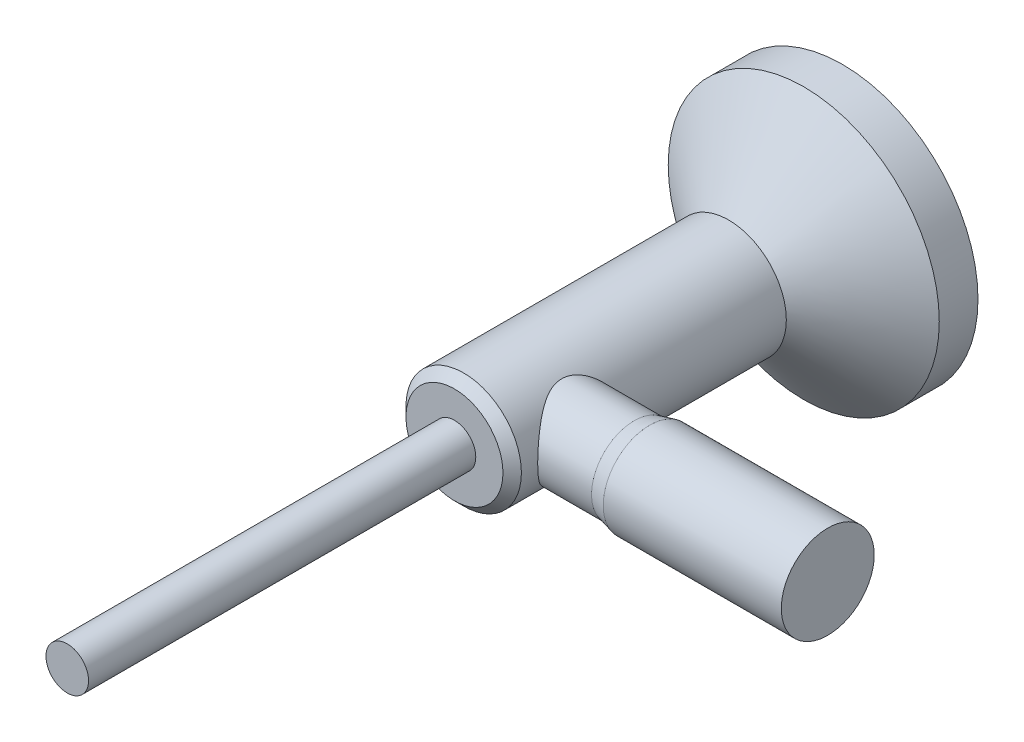
ISO-10303-21;
HEADER;
FILE_DESCRIPTION(('STEP AP214'),'2;1');
FILE_NAME('part.step','',(''),(''),'','','');
FILE_SCHEMA(('AUTOMOTIVE_DESIGN { 1 0 10303 214 1 1 1 1 }'));
ENDSEC;
DATA;
#1=APPLICATION_CONTEXT('core data for automotive mechanical design processes');
#2=APPLICATION_PROTOCOL_DEFINITION('international standard','automotive_design',2000,#1);
#3=PRODUCT_CONTEXT('',#1,'mechanical');
#4=PRODUCT('Part','Part','',(#3));
#5=PRODUCT_RELATED_PRODUCT_CATEGORY('part','',(#4));
#6=PRODUCT_DEFINITION_FORMATION('','',#4);
#7=PRODUCT_DEFINITION_CONTEXT('part definition',#1,'design');
#8=PRODUCT_DEFINITION('design','',#6,#7);
#9=PRODUCT_DEFINITION_SHAPE('','',#8);
#10=(LENGTH_UNIT() NAMED_UNIT(*) SI_UNIT(.MILLI.,.METRE.));
#11=(NAMED_UNIT(*) PLANE_ANGLE_UNIT() SI_UNIT($,.RADIAN.));
#12=(NAMED_UNIT(*) SI_UNIT($,.STERADIAN.) SOLID_ANGLE_UNIT());
#13=UNCERTAINTY_MEASURE_WITH_UNIT(LENGTH_MEASURE(1.E-05),#10,'distance_accuracy_value','');
#14=(GEOMETRIC_REPRESENTATION_CONTEXT(3) GLOBAL_UNCERTAINTY_ASSIGNED_CONTEXT((#13)) GLOBAL_UNIT_ASSIGNED_CONTEXT((#10,
#11,#12)) REPRESENTATION_CONTEXT('',''));
#15=CARTESIAN_POINT('',(0.,0.,0.));
#16=DIRECTION('',(0.,0.,1.));
#17=DIRECTION('',(1.,0.,0.));
#18=AXIS2_PLACEMENT_3D('',#15,#16,#17);
#19=CARTESIAN_POINT('',(0.,0.,50.1));
#20=DIRECTION('',(0.,0.,-1.));
#21=DIRECTION('',(-1.,0.,0.));
#22=AXIS2_PLACEMENT_3D('',#19,#20,#21);
#23=CYLINDRICAL_SURFACE('',#22,7.45);
#24=CARTESIAN_POINT('',(0.,0.,48.91));
#25=DIRECTION('',(0.,0.,1.));
#26=DIRECTION('',(1.,0.,0.));
#27=AXIS2_PLACEMENT_3D('',#24,#25,#26);
#28=CIRCLE('',#27,7.45);
#29=CARTESIAN_POINT('',(7.45,0.,48.91));
#30=VERTEX_POINT('',#29);
#31=EDGE_CURVE('E49',#30,#30,#28,.F.);
#32=ORIENTED_EDGE('',*,*,#31,.T.);
#33=EDGE_LOOP('',(#32));
#34=FACE_BOUND('',#33,.T.);
#35=CARTESIAN_POINT('',(0.,0.,14.7));
#36=DIRECTION('',(0.,0.,1.));
#37=DIRECTION('',(1.,0.,0.));
#38=AXIS2_PLACEMENT_3D('',#35,#36,#37);
#39=CIRCLE('',#38,7.45);
#40=CARTESIAN_POINT('',(7.45,0.,14.7));
#41=VERTEX_POINT('',#40);
#42=EDGE_CURVE('E113',#41,#41,#39,.T.);
#43=ORIENTED_EDGE('',*,*,#42,.T.);
#44=EDGE_LOOP('',(#43));
#45=FACE_BOUND('',#44,.T.);
#46=CARTESIAN_POINT('',(7.45,0.,46.8));
#47=CARTESIAN_POINT('',(7.450000486101,-0.135019458593923,46.8000005141358));
#48=CARTESIAN_POINT('',(7.44632219923632,-0.270032839258495,46.7950212855718));
#49=CARTESIAN_POINT('',(7.43169815251342,-0.538985340011845,46.7751879005484));
#50=CARTESIAN_POINT('',(7.42074970160522,-0.672924043722487,46.7603300875302));
#51=CARTESIAN_POINT('',(7.39184729895434,-0.9385877035249,46.7209855450049));
#52=CARTESIAN_POINT('',(7.37389420686385,-1.07031292919976,46.6964999970691));
#53=CARTESIAN_POINT('',(7.33138754280582,-1.33066367835124,46.6382711386633));
#54=CARTESIAN_POINT('',(7.30683110939465,-1.45928783163998,46.6045238146319));
#55=CARTESIAN_POINT('',(7.25180537769183,-1.71184827574825,46.5284670413951));
#56=CARTESIAN_POINT('',(7.22137023076594,-1.83580692596372,46.486206987383));
#57=CARTESIAN_POINT('',(7.15510269098157,-2.07916770368903,46.3935290824373));
#58=CARTESIAN_POINT('',(7.11926816916999,-2.19856801048152,46.3431080130618));
#59=CARTESIAN_POINT('',(7.00466209995162,-2.54901546437438,46.180446253102));
#60=CARTESIAN_POINT('',(6.91873854566016,-2.77252833817957,46.0567397830527));
#61=CARTESIAN_POINT('',(6.7249767621068,-3.21575231262227,45.7704513796907));
#62=CARTESIAN_POINT('',(6.61585223742397,-3.43324080201589,45.6053467935411));
#63=CARTESIAN_POINT('',(6.38870455841173,-3.83941362643512,45.2474404781813));
#64=CARTESIAN_POINT('',(6.27066830525156,-4.02805427819545,45.0545975861147));
#65=CARTESIAN_POINT('',(6.08134260993173,-4.3053034012533,44.7264040763676));
#66=CARTESIAN_POINT('',(6.0102930897951,-4.40368577346437,44.5990186175818));
#67=CARTESIAN_POINT('',(5.86975893861383,-4.58933172885816,44.335461330077));
#68=CARTESIAN_POINT('',(5.80027477073608,-4.67659205584361,44.1992869457243));
#69=CARTESIAN_POINT('',(5.66514739944463,-4.83939945668332,43.9184939116281));
#70=CARTESIAN_POINT('',(5.59950014045067,-4.91495904280386,43.7738845130287));
#71=CARTESIAN_POINT('',(5.47456219475328,-5.05374916866248,43.4763688744005));
#72=CARTESIAN_POINT('',(5.41526793783756,-5.11698664961671,43.3234673678531));
#73=CARTESIAN_POINT('',(5.28810095160074,-5.24875333895413,42.9581537446772));
#74=CARTESIAN_POINT('',(5.22373565849846,-5.31228408284939,42.7425942184785));
#75=CARTESIAN_POINT('',(5.14536790644501,-5.38785688611981,42.4108003817203));
#76=CARTESIAN_POINT('',(5.12228314922296,-5.4097538951355,42.2988579572337));
#77=CARTESIAN_POINT('',(5.08302472939188,-5.44665854692892,42.0726693241491));
#78=CARTESIAN_POINT('',(5.06684757293834,-5.46166967285253,41.9584243108891));
#79=CARTESIAN_POINT('',(5.04201202171943,-5.48460630454058,41.7274132506697));
#80=CARTESIAN_POINT('',(5.0334187547392,-5.49247045134611,41.6106340254534));
#81=CARTESIAN_POINT('',(5.02440752742795,-5.50071518777274,41.3764958030607));
#82=CARTESIAN_POINT('',(5.02398921940845,-5.50109609566283,41.2591368307537));
#83=CARTESIAN_POINT('',(5.03135144579266,-5.49436315375481,41.0248316849857));
#84=CARTESIAN_POINT('',(5.03913645136315,-5.48724521675679,40.9078857715351));
#85=CARTESIAN_POINT('',(5.06252538772141,-5.46567348545005,40.6754668439777));
#86=CARTESIAN_POINT('',(5.07813017889333,-5.45121888391109,40.5599939933811));
#87=CARTESIAN_POINT('',(5.11841445080765,-5.41342488438579,40.3196410592587));
#88=CARTESIAN_POINT('',(5.14385968987857,-5.38932711143999,40.1950088305846));
#89=CARTESIAN_POINT('',(5.20216856833407,-5.3330653125853,39.9493241036273));
#90=CARTESIAN_POINT('',(5.23503716222852,-5.30089589788714,39.8282740574803));
#91=CARTESIAN_POINT('',(5.34287105318585,-5.19293068721941,39.4709534137172));
#92=CARTESIAN_POINT('',(5.42701329006843,-5.10572277214488,39.2407866817355));
#93=CARTESIAN_POINT('',(5.58031756374245,-4.93671279925376,38.8697332254147));
#94=CARTESIAN_POINT('',(5.6456806582952,-4.86208039880709,38.7238108417375));
#95=CARTESIAN_POINT('',(5.78047024466221,-4.70102974079245,38.440480884177));
#96=CARTESIAN_POINT('',(5.84989809668093,-4.61460752493874,38.3030761926343));
#97=CARTESIAN_POINT('',(5.99061149543245,-4.43040948051434,38.0369184224878));
#98=CARTESIAN_POINT('',(6.06189877157229,-4.33262276719967,37.908173827808));
#99=CARTESIAN_POINT('',(6.20432572080933,-4.12608497718545,37.6597380543207));
#100=CARTESIAN_POINT('',(6.27546541024707,-4.01733518858694,37.5400458147968));
#101=CARTESIAN_POINT('',(6.41694042359449,-3.78733255021641,37.3083628806047));
#102=CARTESIAN_POINT('',(6.48724620707226,-3.66591208641068,37.196520245622));
#103=CARTESIAN_POINT('',(6.62418692275544,-3.4122459566642,36.9832850585178));
#104=CARTESIAN_POINT('',(6.69082145547511,-3.27999911653231,36.8818936426005));
#105=CARTESIAN_POINT('',(6.81860613459969,-3.00533033204449,36.6906685237157));
#106=CARTESIAN_POINT('',(6.87976666430903,-2.86292861362233,36.6008127923865));
#107=CARTESIAN_POINT('',(6.99508249609034,-2.56832914069526,36.4335487435955));
#108=CARTESIAN_POINT('',(7.04924040888451,-2.41613506886164,36.3561357845757));
#109=CARTESIAN_POINT('',(7.13621154881264,-2.14288963573746,36.2330094185123));
#110=CARTESIAN_POINT('',(7.17094351690687,-2.02381204003309,36.1842495487851));
#111=CARTESIAN_POINT('',(7.2350088382771,-1.78125520573237,36.0948268850267));
#112=CARTESIAN_POINT('',(7.26434339114959,-1.65777695249939,36.0541622916239));
#113=CARTESIAN_POINT('',(7.31702705028384,-1.40712697114765,35.9814463890465));
#114=CARTESIAN_POINT('',(7.34037924798169,-1.27995718864046,35.9493906307632));
#115=CARTESIAN_POINT('',(7.38062463675137,-1.02265971948758,35.8943109643801));
#116=CARTESIAN_POINT('',(7.39751766698041,-0.892531959269352,35.871287281192));
#117=CARTESIAN_POINT('',(7.42451943848907,-0.629708602602006,35.8345498798639));
#118=CARTESIAN_POINT('',(7.43459967886032,-0.497004578912932,35.8208752703012));
#119=CARTESIAN_POINT('',(7.44762424349014,-0.230601856620336,35.8032152514379));
#120=CARTESIAN_POINT('',(7.45056857724733,-0.0969031593410616,35.7992298292399));
#121=CARTESIAN_POINT('',(7.44925019338425,0.170391950321274,35.801015655425));
#122=CARTESIAN_POINT('',(7.44498752920273,0.303988363455408,35.8067868314644));
#123=CARTESIAN_POINT('',(7.42935848088875,0.56998576200324,35.8279877158631));
#124=CARTESIAN_POINT('',(7.41799233561598,0.702386787460855,35.8434170994582));
#125=CARTESIAN_POINT('',(7.38937676239725,0.956496358037278,35.8823849821495));
#126=CARTESIAN_POINT('',(7.37255414233543,1.07834370318576,35.9053361842937));
#127=CARTESIAN_POINT('',(7.33326109650566,1.3193631552748,35.9591618788812));
#128=CARTESIAN_POINT('',(7.3107887493593,1.43853433704692,35.9900390668961));
#129=CARTESIAN_POINT('',(7.23550792067242,1.79094132264636,36.0940037903012));
#130=CARTESIAN_POINT('',(7.17481312231734,2.01926240205647,36.1784546242394));
#131=CARTESIAN_POINT('',(7.03119931111775,2.47512724804147,36.3815843386185));
#132=CARTESIAN_POINT('',(6.94693853194631,2.70128412511467,36.5023821929634));
#133=CARTESIAN_POINT('',(6.76428371538492,3.13072963795313,36.77090265567));
#134=CARTESIAN_POINT('',(6.66588151914327,3.33400495069193,36.9186408204923));
#135=CARTESIAN_POINT('',(6.44179179209608,3.75122450320924,37.2669884948347));
#136=CARTESIAN_POINT('',(6.31440858456013,3.96029801735132,37.4723255534379));
#137=CARTESIAN_POINT('',(6.05743313163926,4.34316706492005,37.9129348253169));
#138=CARTESIAN_POINT('',(5.92783877099392,4.51692649670822,38.1482372766247));
#139=CARTESIAN_POINT('',(5.7460586993252,4.74274864373499,38.5117446481609));
#140=CARTESIAN_POINT('',(5.68997135582281,4.80974394040677,38.6289112914586));
#141=CARTESIAN_POINT('',(5.58124078215675,4.93549987098832,38.8691064408317));
#142=CARTESIAN_POINT('',(5.52859776915992,4.99425998593184,38.9921353156802));
#143=CARTESIAN_POINT('',(5.37831276483957,5.15732327585902,39.3694759856688));
#144=CARTESIAN_POINT('',(5.2879813572329,5.24880763196806,39.6326759475614));
#145=CARTESIAN_POINT('',(5.15966841115067,5.37461552771487,40.1129151304156));
#146=CARTESIAN_POINT('',(5.11430739717961,5.41741575225532,40.3257020095138));
#147=CARTESIAN_POINT('',(5.0658799619334,5.46258228172044,40.6502597640486));
#148=CARTESIAN_POINT('',(5.05300730686033,5.47446486544369,40.7593125309629));
#149=CARTESIAN_POINT('',(5.03427877208945,5.49169488037731,40.9785155352214));
#150=CARTESIAN_POINT('',(5.02842035211825,5.49704467751378,41.0886653606736));
#151=CARTESIAN_POINT('',(5.02397767853765,5.50110488586305,41.3095765532073));
#152=CARTESIAN_POINT('',(5.02541616542765,5.49979454100168,41.4203387561794));
#153=CARTESIAN_POINT('',(5.03555095430713,5.49051667508094,41.6412447938616));
#154=CARTESIAN_POINT('',(5.04424719934845,5.48254920625684,41.7513886334168));
#155=CARTESIAN_POINT('',(5.06853112465503,5.46010653011939,41.9703446016663));
#156=CARTESIAN_POINT('',(5.08412558122923,5.44562492354684,42.0791553125084));
#157=CARTESIAN_POINT('',(5.12158696806766,5.41040710319368,42.2947016837112));
#158=CARTESIAN_POINT('',(5.14345709733763,5.38966769924076,42.4014362560617));
#159=CARTESIAN_POINT('',(5.19936820852396,5.33581831565247,42.6408589302919));
#160=CARTESIAN_POINT('',(5.23510132752425,5.30087903193012,42.7727417267996));
#161=CARTESIAN_POINT('',(5.31374732876396,5.22203843533893,43.0316627434205));
#162=CARTESIAN_POINT('',(5.3566658009176,5.17813013904173,43.1586970964169));
#163=CARTESIAN_POINT('',(5.44808284756704,5.08186043842302,43.4077362410937));
#164=CARTESIAN_POINT('',(5.49659218116849,5.02948265460939,43.5297307001153));
#165=CARTESIAN_POINT('',(5.59758409112259,4.91683590270793,43.7682206786451));
#166=CARTESIAN_POINT('',(5.65006531675744,4.85656961221656,43.884718045859));
#167=CARTESIAN_POINT('',(5.77333661285875,4.70985473812738,44.1452882719613));
#168=CARTESIAN_POINT('',(5.84501307878994,4.62088856708074,44.2875293132532));
#169=CARTESIAN_POINT('',(5.99031979512397,4.43090107781332,44.562679021548));
#170=CARTESIAN_POINT('',(6.06395053560598,4.32987671308233,44.6955853165916));
#171=CARTESIAN_POINT('',(6.211060528061,4.11607518071445,44.9518182201894));
#172=CARTESIAN_POINT('',(6.28453968373324,4.00329205106679,45.0751399132397));
#173=CARTESIAN_POINT('',(6.42937294776092,3.76629130969224,45.3116164333594));
#174=CARTESIAN_POINT('',(6.50072726097624,3.64207480503242,45.4247722426754));
#175=CARTESIAN_POINT('',(6.63975469649077,3.3820076403295,45.6405845799124));
#176=CARTESIAN_POINT('',(6.70741368670676,3.24611682230352,45.7432019651793));
#177=CARTESIAN_POINT('',(6.83699285944623,2.96347666779423,45.9364978474031));
#178=CARTESIAN_POINT('',(6.89891258221888,2.81672646309734,46.027175388149));
#179=CARTESIAN_POINT('',(7.01512754921521,2.51332863324963,46.1952210285571));
#180=CARTESIAN_POINT('',(7.06943760345273,2.35670111826006,46.2726150487229));
#181=CARTESIAN_POINT('',(7.16885202141445,2.03432479622376,46.4129633402488));
#182=CARTESIAN_POINT('',(7.2139597392386,1.86857934058326,46.475922873781));
#183=CARTESIAN_POINT('',(7.28525957439485,1.56418947590783,46.5747911948319));
#184=CARTESIAN_POINT('',(7.31343362965212,1.42694458749129,46.613599197172));
#185=CARTESIAN_POINT('',(7.3622804921818,1.14859710719614,46.6806321910422));
#186=CARTESIAN_POINT('',(7.38295496411308,1.00749537889478,46.708859531175));
#187=CARTESIAN_POINT('',(7.41624966104453,0.722690307571883,46.7542181874457));
#188=CARTESIAN_POINT('',(7.42887613147247,0.578989071107694,46.7713581078216));
#189=CARTESIAN_POINT('',(7.44575087523034,0.290189513523673,46.7942485141783));
#190=CARTESIAN_POINT('',(7.44999947763825,0.145091247503364,46.7999994475121));
#191=CARTESIAN_POINT('',(7.45,0.,46.8));
#192=B_SPLINE_CURVE_WITH_KNOTS('',3,(#46,#47,#48,#49,#50,#51,#52,#53,#54,#55,#56,#57,#58,#59,
#60,#61,#62,#63,#64,#65,#66,#67,#68,#69,#70,#71,#72,#73,#74,#75,#76,#77,#78,#79,#80,#81,#82,#83,
#84,#85,#86,#87,#88,#89,#90,#91,#92,#93,#94,#95,#96,#97,#98,#99,#100,#101,#102,#103,#104,#105,
#106,#107,#108,#109,#110,#111,#112,#113,#114,#115,#116,#117,#118,#119,#120,#121,#122,#123,#124,
#125,#126,#127,#128,#129,#130,#131,#132,#133,#134,#135,#136,#137,#138,#139,#140,#141,#142,#143,
#144,#145,#146,#147,#148,#149,#150,#151,#152,#153,#154,#155,#156,#157,#158,#159,#160,#161,#162,
#163,#164,#165,#166,#167,#168,#169,#170,#171,#172,#173,#174,#175,#176,#177,#178,#179,#180,#181,
#182,#183,#184,#185,#186,#187,#188,#189,#190,#191),.UNSPECIFIED.,.T.,.F.,(4,2,2,2,2,2,2,2,2,2,2,
2,2,2,2,2,2,2,2,2,2,2,2,2,2,2,2,2,2,2,2,2,2,2,2,2,2,2,2,2,2,2,2,2,2,2,2,2,2,2,2,2,2,2,2,2,2,2,2,
2,2,2,2,2,2,2,2,2,2,2,2,2,4),(0.,0.404907429741863,0.809964819506974,1.21497251379279,
1.62015599476134,2.02305282192515,2.42610892752499,3.23152520477046,4.11069908411092,
4.99119135669979,5.51851353807913,6.0459897504932,6.57289794844336,7.09950846798783,
7.79783710626463,8.14661363775009,8.49521354950535,8.84677877502025,9.19832904811213,
9.55007103072747,9.90185172280483,10.2896630286505,10.6777339372023,11.4547132149265,
11.9835306539278,12.5125260758485,13.0420324032904,13.5714765890022,14.1091238969619,
14.6468295937284,15.1834927196246,15.7199551857979,16.1194037290293,16.518763385747,
16.9179162515587,17.317079056218,17.7179015666721,18.1187235435904,18.5195425484913,
18.9203480762889,19.2952989128703,19.6703774369071,20.4199546537079,21.2266902154778,
22.0338931037647,22.989012218223,23.9451028945316,24.3832396766988,24.8214040570499,
25.6952974872321,26.3576097802786,26.6885918563516,27.0194540277577,27.3513479493187,
27.6832392666913,28.0154573368454,28.3478450559364,28.7703100360001,29.193105217099,
29.6167280596519,30.0402074829446,30.5868264236729,31.1335837615167,31.6806196807947,
32.2276026874687,32.7765489700372,33.3255391886626,33.8734456578762,34.4211520660085,
34.85671577934,35.2921827527213,35.727311381309,36.1624229179455),.UNSPECIFIED.);
#193=CARTESIAN_POINT('',(7.45,0.,46.8));
#194=VERTEX_POINT('',#193);
#195=EDGE_CURVE('E57',#194,#194,#192,.T.);
#196=ORIENTED_EDGE('',*,*,#195,.F.);
#197=EDGE_LOOP('',(#196));
#198=FACE_BOUND('',#197,.T.);
#199=ADVANCED_FACE('F41',(#34,#45,#198),#23,.T.);
#200=CARTESIAN_POINT('',(0.,0.,5.));
#201=DIRECTION('',(0.,0.,-1.));
#202=DIRECTION('',(-1.,0.,0.));
#203=AXIS2_PLACEMENT_3D('',#200,#201,#202);
#204=CYLINDRICAL_SURFACE('',#203,17.5);
#205=CARTESIAN_POINT('',(0.,0.,4.99999999999997));
#206=DIRECTION('',(0.,0.,1.));
#207=DIRECTION('',(1.,0.,0.));
#208=AXIS2_PLACEMENT_3D('',#205,#206,#207);
#209=CIRCLE('',#208,17.5);
#210=CARTESIAN_POINT('',(-17.5,0.,4.99999999999997));
#211=VERTEX_POINT('',#210);
#212=EDGE_CURVE('E68',#211,#211,#209,.F.);
#213=ORIENTED_EDGE('',*,*,#212,.T.);
#214=EDGE_LOOP('',(#213));
#215=FACE_BOUND('',#214,.T.);
#216=CARTESIAN_POINT('',(0.,0.,0.));
#217=DIRECTION('',(0.,0.,1.));
#218=DIRECTION('',(1.,0.,0.));
#219=AXIS2_PLACEMENT_3D('',#216,#217,#218);
#220=CIRCLE('',#219,17.5);
#221=CARTESIAN_POINT('',(17.5,0.,0.));
#222=VERTEX_POINT('',#221);
#223=EDGE_CURVE('E116',#222,#222,#220,.T.);
#224=ORIENTED_EDGE('',*,*,#223,.T.);
#225=EDGE_LOOP('',(#224));
#226=FACE_BOUND('',#225,.T.);
#227=ADVANCED_FACE('F102',(#215,#226),#204,.T.);
#228=CARTESIAN_POINT('',(0.,0.,0.));
#229=DIRECTION('',(0.,0.,1.));
#230=DIRECTION('',(1.,0.,0.));
#231=AXIS2_PLACEMENT_3D('',#228,#229,#230);
#232=PLANE('',#231);
#233=ORIENTED_EDGE('',*,*,#223,.F.);
#234=EDGE_LOOP('',(#233));
#235=FACE_BOUND('',#234,.T.);
#236=ADVANCED_FACE('F106',(#235),#232,.F.);
#237=CARTESIAN_POINT('',(0.,0.,14.7));
#238=DIRECTION('',(0.,0.,-1.));
#239=DIRECTION('',(-1.,0.,0.));
#240=AXIS2_PLACEMENT_3D('',#237,#238,#239);
#241=CONICAL_SURFACE('',#240,4.44999999999995,0.931600234456651);
#242=CARTESIAN_POINT('',(0.,0.,14.7));
#243=DIRECTION('',(0.,0.,1.));
#244=DIRECTION('',(1.,0.,0.));
#245=AXIS2_PLACEMENT_3D('',#242,#243,#244);
#246=CIRCLE('',#245,4.44999999999995);
#247=CARTESIAN_POINT('',(-4.44999999999995,0.,14.7));
#248=VERTEX_POINT('',#247);
#249=EDGE_CURVE('E120',#248,#248,#246,.T.);
#250=CARTESIAN_POINT('',(-17.5,0.,4.99999999999997));
#251=CARTESIAN_POINT('',(-17.3640625,0.,5.10104166666664));
#252=CARTESIAN_POINT('',(-17.228125,0.,5.20208333333331));
#253=CARTESIAN_POINT('',(-16.95625,0.,5.40416666666664));
#254=CARTESIAN_POINT('',(-16.8203125,0.,5.50520833333331));
#255=CARTESIAN_POINT('',(-16.5484375,0.,5.70729166666664));
#256=CARTESIAN_POINT('',(-16.4125,0.,5.80833333333331));
#257=CARTESIAN_POINT('',(-16.140625,0.,6.01041666666664));
#258=CARTESIAN_POINT('',(-16.0046875,0.,6.11145833333331));
#259=CARTESIAN_POINT('',(-15.7328125,0.,6.31354166666664));
#260=CARTESIAN_POINT('',(-15.596875,0.,6.41458333333331));
#261=CARTESIAN_POINT('',(-15.325,0.,6.61666666666664));
#262=CARTESIAN_POINT('',(-15.1890625,0.,6.71770833333331));
#263=CARTESIAN_POINT('',(-14.9171875,0.,6.91979166666664));
#264=CARTESIAN_POINT('',(-14.78125,0.,7.02083333333331));
#265=CARTESIAN_POINT('',(-14.509375,0.,7.22291666666665));
#266=CARTESIAN_POINT('',(-14.3734375,0.,7.32395833333331));
#267=CARTESIAN_POINT('',(-14.1015625,0.,7.52604166666665));
#268=CARTESIAN_POINT('',(-13.965625,0.,7.62708333333331));
#269=CARTESIAN_POINT('',(-13.69375,0.,7.82916666666665));
#270=CARTESIAN_POINT('',(-13.5578125,0.,7.93020833333331));
#271=CARTESIAN_POINT('',(-13.2859375,0.,8.13229166666665));
#272=CARTESIAN_POINT('',(-13.15,0.,8.23333333333331));
#273=CARTESIAN_POINT('',(-12.878125,0.,8.43541666666665));
#274=CARTESIAN_POINT('',(-12.7421875,0.,8.53645833333331));
#275=CARTESIAN_POINT('',(-12.4703125,0.,8.73854166666665));
#276=CARTESIAN_POINT('',(-12.334375,0.,8.83958333333332));
#277=CARTESIAN_POINT('',(-12.0625,0.,9.04166666666665));
#278=CARTESIAN_POINT('',(-11.9265625,0.,9.14270833333332));
#279=CARTESIAN_POINT('',(-11.6546875,0.,9.34479166666665));
#280=CARTESIAN_POINT('',(-11.51875,0.,9.44583333333332));
#281=CARTESIAN_POINT('',(-11.246875,0.,9.64791666666665));
#282=CARTESIAN_POINT('',(-11.1109375,0.,9.74895833333332));
#283=CARTESIAN_POINT('',(-10.8390625,0.,9.95104166666665));
#284=CARTESIAN_POINT('',(-10.703125,0.,10.0520833333333));
#285=CARTESIAN_POINT('',(-10.43125,0.,10.2541666666667));
#286=CARTESIAN_POINT('',(-10.2953125,0.,10.3552083333333));
#287=CARTESIAN_POINT('',(-10.0234375,0.,10.5572916666667));
#288=CARTESIAN_POINT('',(-9.88749999999997,0.,10.6583333333333));
#289=CARTESIAN_POINT('',(-9.61562499999997,0.,10.8604166666667));
#290=CARTESIAN_POINT('',(-9.47968749999997,0.,10.9614583333333));
#291=CARTESIAN_POINT('',(-9.20781249999997,0.,11.1635416666667));
#292=CARTESIAN_POINT('',(-9.07187499999997,0.,11.2645833333333));
#293=CARTESIAN_POINT('',(-8.79999999999997,0.,11.4666666666667));
#294=CARTESIAN_POINT('',(-8.66406249999997,0.,11.5677083333333));
#295=CARTESIAN_POINT('',(-8.39218749999996,0.,11.7697916666667));
#296=CARTESIAN_POINT('',(-8.25624999999996,0.,11.8708333333333));
#297=CARTESIAN_POINT('',(-7.98437499999996,0.,12.0729166666667));
#298=CARTESIAN_POINT('',(-7.84843749999996,0.,12.1739583333333));
#299=CARTESIAN_POINT('',(-7.57656249999996,0.,12.3760416666667));
#300=CARTESIAN_POINT('',(-7.44062499999996,0.,12.4770833333333));
#301=CARTESIAN_POINT('',(-7.16874999999996,0.,12.6791666666667));
#302=CARTESIAN_POINT('',(-7.03281249999996,0.,12.7802083333333));
#303=CARTESIAN_POINT('',(-6.76093749999996,0.,12.9822916666667));
#304=CARTESIAN_POINT('',(-6.62499999999996,0.,13.0833333333333));
#305=CARTESIAN_POINT('',(-6.35312499999996,0.,13.2854166666667));
#306=CARTESIAN_POINT('',(-6.21718749999995,0.,13.3864583333333));
#307=CARTESIAN_POINT('',(-5.94531249999995,0.,13.5885416666667));
#308=CARTESIAN_POINT('',(-5.80937499999995,0.,13.6895833333333));
#309=CARTESIAN_POINT('',(-5.53749999999995,0.,13.8916666666667));
#310=CARTESIAN_POINT('',(-5.40156249999995,0.,13.9927083333333));
#311=CARTESIAN_POINT('',(-5.12968749999995,0.,14.1947916666667));
#312=CARTESIAN_POINT('',(-4.99374999999995,0.,14.2958333333333));
#313=CARTESIAN_POINT('',(-4.72187499999995,0.,14.4979166666667));
#314=CARTESIAN_POINT('',(-4.58593749999995,0.,14.5989583333333));
#315=CARTESIAN_POINT('',(-4.44999999999995,0.,14.7));
#316=B_SPLINE_CURVE_WITH_KNOTS('',3,(#250,#251,#252,#253,#254,#255,#256,#257,#258,#259,#260,
#261,#262,#263,#264,#265,#266,#267,#268,#269,#270,#271,#272,#273,#274,#275,#276,#277,#278,#279,
#280,#281,#282,#283,#284,#285,#286,#287,#288,#289,#290,#291,#292,#293,#294,#295,#296,#297,#298,
#299,#300,#301,#302,#303,#304,#305,#306,#307,#308,#309,#310,#311,#312,#313,#314,#315),
.UNSPECIFIED.,.F.,.F.,(4,2,2,2,2,2,2,2,2,2,2,2,2,2,2,2,2,2,2,2,2,2,2,2,2,2,2,2,2,2,2,2,4),(0.,
0.508129708619024,1.01625941723804,1.52438912585706,2.03251883447609,2.54064854309511,
3.04877825171413,3.55690796033315,4.06503766895217,4.5731673775712,5.08129708619022,
5.58942679480924,6.09755650342826,6.60568621204728,7.11381592066631,7.62194562928533,
8.13007533790435,8.63820504652337,9.14633475514239,9.65446446376141,10.1625941723804,
10.6707238809995,11.1788535896185,11.6869832982375,12.1951130068565,12.7032427154755,
13.2113724240946,13.7195021327136,14.2276318413326,14.7357615499516,15.2438912585707,
15.7520209671897,16.2601506758087),.UNSPECIFIED.);
#317=EDGE_CURVE('BSEAM93',#211,#248,#316,.T.);
#318=ORIENTED_EDGE('',*,*,#212,.F.);
#319=ORIENTED_EDGE('',*,*,#249,.F.);
#320=ORIENTED_EDGE('',*,*,#317,.T.);
#321=ORIENTED_EDGE('',*,*,#317,.F.);
#322=EDGE_LOOP('',(#318,#320,#319,#321));
#323=FACE_BOUND('',#322,.T.);
#324=ADVANCED_FACE('F93',(#323),#241,.T.);
#325=CARTESIAN_POINT('',(0.,0.,50.1));
#326=DIRECTION('',(0.,0.,1.));
#327=DIRECTION('',(1.,0.,0.));
#328=AXIS2_PLACEMENT_3D('',#325,#326,#327);
#329=PLANE('',#328);
#330=CARTESIAN_POINT('',(0.,0.,50.1));
#331=DIRECTION('',(0.,0.,1.));
#332=DIRECTION('',(1.,0.,0.));
#333=AXIS2_PLACEMENT_3D('',#330,#331,#332);
#334=CIRCLE('',#333,6.25999999999999);
#335=CARTESIAN_POINT('',(6.25999999999999,0.,50.1));
#336=VERTEX_POINT('',#335);
#337=EDGE_CURVE('E53',#336,#336,#334,.T.);
#338=ORIENTED_EDGE('',*,*,#337,.T.);
#339=EDGE_LOOP('',(#338));
#340=FACE_BOUND('',#339,.T.);
#341=CARTESIAN_POINT('',(0.,0.,50.1));
#342=DIRECTION('',(0.,0.,1.));
#343=DIRECTION('',(1.,0.,0.));
#344=AXIS2_PLACEMENT_3D('',#341,#342,#343);
#345=CIRCLE('',#344,2.75);
#346=CARTESIAN_POINT('',(2.75,0.,50.1));
#347=VERTEX_POINT('',#346);
#348=EDGE_CURVE('E67',#347,#347,#345,.T.);
#349=ORIENTED_EDGE('',*,*,#348,.F.);
#350=EDGE_LOOP('',(#349));
#351=FACE_BOUND('',#350,.T.);
#352=ADVANCED_FACE('F91',(#340,#351),#329,.T.);
#353=CARTESIAN_POINT('',(0.,0.,14.7));
#354=DIRECTION('',(0.,0.,1.));
#355=DIRECTION('',(1.,0.,0.));
#356=AXIS2_PLACEMENT_3D('',#353,#354,#355);
#357=PLANE('',#356);
#358=ORIENTED_EDGE('',*,*,#249,.T.);
#359=EDGE_LOOP('',(#358));
#360=FACE_BOUND('',#359,.T.);
#361=ORIENTED_EDGE('',*,*,#42,.F.);
#362=EDGE_LOOP('',(#361));
#363=FACE_BOUND('',#362,.T.);
#364=ADVANCED_FACE('F89',(#360,#363),#357,.F.);
#365=CARTESIAN_POINT('',(0.,0.,100.1));
#366=DIRECTION('',(0.,0.,-1.));
#367=DIRECTION('',(-1.,0.,0.));
#368=AXIS2_PLACEMENT_3D('',#365,#366,#367);
#369=CYLINDRICAL_SURFACE('',#368,2.75);
#370=CARTESIAN_POINT('',(0.,0.,100.1));
#371=DIRECTION('',(0.,0.,1.));
#372=DIRECTION('',(1.,0.,0.));
#373=AXIS2_PLACEMENT_3D('',#370,#371,#372);
#374=CIRCLE('',#373,2.75);
#375=CARTESIAN_POINT('',(2.75,0.,100.1));
#376=VERTEX_POINT('',#375);
#377=EDGE_CURVE('E117',#376,#376,#374,.T.);
#378=ORIENTED_EDGE('',*,*,#377,.F.);
#379=EDGE_LOOP('',(#378));
#380=FACE_BOUND('',#379,.T.);
#381=ORIENTED_EDGE('',*,*,#348,.T.);
#382=EDGE_LOOP('',(#381));
#383=FACE_BOUND('',#382,.T.);
#384=ADVANCED_FACE('F85',(#380,#383),#369,.T.);
#385=CARTESIAN_POINT('',(0.,0.,100.1));
#386=DIRECTION('',(0.,0.,1.));
#387=DIRECTION('',(1.,0.,0.));
#388=AXIS2_PLACEMENT_3D('',#385,#386,#387);
#389=PLANE('',#388);
#390=ORIENTED_EDGE('',*,*,#377,.T.);
#391=EDGE_LOOP('',(#390));
#392=FACE_BOUND('',#391,.T.);
#393=ADVANCED_FACE('F79',(#392),#389,.T.);
#394=CARTESIAN_POINT('',(14.4,0.,41.3));
#395=DIRECTION('',(-1.,0.,0.));
#396=DIRECTION('',(0.,0.,1.));
#397=AXIS2_PLACEMENT_3D('',#394,#395,#396);
#398=CYLINDRICAL_SURFACE('',#397,5.5);
#399=CARTESIAN_POINT('',(14.4,0.,41.3));
#400=DIRECTION('',(1.,0.,0.));
#401=DIRECTION('',(0.,0.,-1.));
#402=AXIS2_PLACEMENT_3D('',#399,#400,#401);
#403=CIRCLE('',#402,5.5);
#404=CARTESIAN_POINT('',(14.4,0.,35.8));
#405=VERTEX_POINT('',#404);
#406=EDGE_CURVE('E123',#405,#405,#403,.T.);
#407=ORIENTED_EDGE('',*,*,#406,.F.);
#408=EDGE_LOOP('',(#407));
#409=FACE_BOUND('',#408,.T.);
#410=ORIENTED_EDGE('',*,*,#195,.T.);
#411=EDGE_LOOP('',(#410));
#412=FACE_BOUND('',#411,.T.);
#413=ADVANCED_FACE('F73',(#409,#412),#398,.T.);
#414=CARTESIAN_POINT('',(0.,0.,50.1));
#415=DIRECTION('',(0.,0.,-1.));
#416=DIRECTION('',(-1.,0.,0.));
#417=AXIS2_PLACEMENT_3D('',#414,#415,#416);
#418=CONICAL_SURFACE('',#417,6.25999999999999,0.785398163397446);
#419=ORIENTED_EDGE('',*,*,#31,.F.);
#420=EDGE_LOOP('',(#419));
#421=FACE_BOUND('',#420,.T.);
#422=ORIENTED_EDGE('',*,*,#337,.F.);
#423=EDGE_LOOP('',(#422));
#424=FACE_BOUND('',#423,.T.);
#425=ADVANCED_FACE('F78',(#421,#424),#418,.T.);
#426=CARTESIAN_POINT('',(39.4,0.,41.3));
#427=DIRECTION('',(-1.,0.,0.));
#428=DIRECTION('',(0.,0.,1.));
#429=AXIS2_PLACEMENT_3D('',#426,#427,#428);
#430=CYLINDRICAL_SURFACE('',#429,6.);
#431=CARTESIAN_POINT('',(16.3999999999999,0.,41.3));
#432=DIRECTION('',(1.,0.,0.));
#433=DIRECTION('',(0.,0.,-1.));
#434=AXIS2_PLACEMENT_3D('',#431,#432,#433);
#435=CIRCLE('',#434,6.);
#436=CARTESIAN_POINT('',(16.3999999999999,0.,35.3));
#437=VERTEX_POINT('',#436);
#438=EDGE_CURVE('E10',#437,#437,#435,.T.);
#439=ORIENTED_EDGE('',*,*,#438,.T.);
#440=EDGE_LOOP('',(#439));
#441=FACE_BOUND('',#440,.T.);
#442=CARTESIAN_POINT('',(39.4,0.,41.3));
#443=DIRECTION('',(1.,0.,0.));
#444=DIRECTION('',(0.,0.,-1.));
#445=AXIS2_PLACEMENT_3D('',#442,#443,#444);
#446=CIRCLE('',#445,6.);
#447=CARTESIAN_POINT('',(39.4,0.,35.3));
#448=VERTEX_POINT('',#447);
#449=EDGE_CURVE('E163',#448,#448,#446,.T.);
#450=ORIENTED_EDGE('',*,*,#449,.F.);
#451=EDGE_LOOP('',(#450));
#452=FACE_BOUND('',#451,.T.);
#453=ADVANCED_FACE('F81',(#441,#452),#430,.T.);
#454=CARTESIAN_POINT('',(39.4,0.,41.3));
#455=DIRECTION('',(1.,0.,0.));
#456=DIRECTION('',(0.,0.,-1.));
#457=AXIS2_PLACEMENT_3D('',#454,#455,#456);
#458=PLANE('',#457);
#459=ORIENTED_EDGE('',*,*,#449,.T.);
#460=EDGE_LOOP('',(#459));
#461=FACE_BOUND('',#460,.T.);
#462=ADVANCED_FACE('F153',(#461),#458,.T.);
#463=CARTESIAN_POINT('',(16.3999999999999,0.,41.3));
#464=DIRECTION('',(1.,0.,0.));
#465=DIRECTION('',(0.,0.,-1.));
#466=AXIS2_PLACEMENT_3D('',#463,#464,#465);
#467=CONICAL_SURFACE('',#466,6.,0.244978663126857);
#468=ORIENTED_EDGE('',*,*,#406,.T.);
#469=EDGE_LOOP('',(#468));
#470=FACE_BOUND('',#469,.T.);
#471=ORIENTED_EDGE('',*,*,#438,.F.);
#472=EDGE_LOOP('',(#471));
#473=FACE_BOUND('',#472,.T.);
#474=ADVANCED_FACE('F44',(#470,#473),#467,.T.);
#475=CLOSED_SHELL('',(#199,#227,#236,#324,#352,#364,#384,#393,#413,#425,#453,#462,#474));
#476=MANIFOLD_SOLID_BREP('B2',#475);
#477=ADVANCED_BREP_SHAPE_REPRESENTATION('',(#18,#476),#14);
#478=SHAPE_DEFINITION_REPRESENTATION(#9,#477);
ENDSEC;
END-ISO-10303-21;
